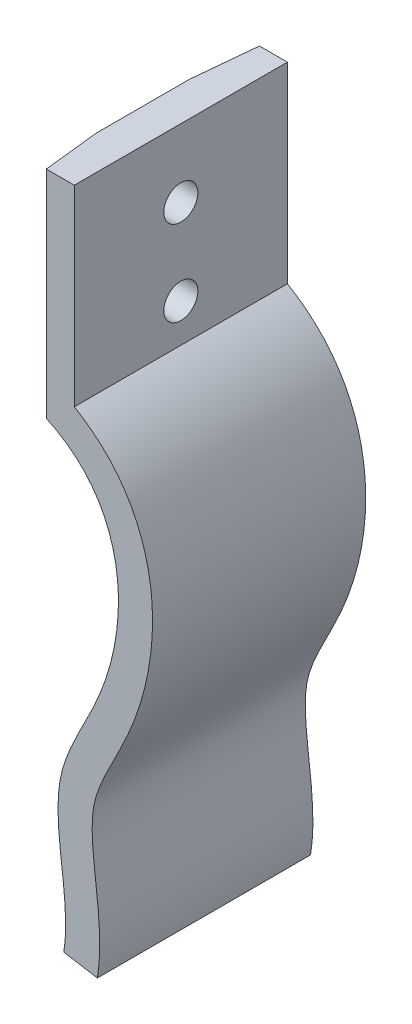
ISO-10303-21;
HEADER;
FILE_DESCRIPTION(('STEP AP214'),'2;1');
FILE_NAME('part.step','',(''),(''),'','','');
FILE_SCHEMA(('AUTOMOTIVE_DESIGN { 1 0 10303 214 1 1 1 1 }'));
ENDSEC;
DATA;
#1=APPLICATION_CONTEXT('core data for automotive mechanical design processes');
#2=APPLICATION_PROTOCOL_DEFINITION('international standard','automotive_design',2000,#1);
#3=PRODUCT_CONTEXT('',#1,'mechanical');
#4=PRODUCT('Part','Part','',(#3));
#5=PRODUCT_RELATED_PRODUCT_CATEGORY('part','',(#4));
#6=PRODUCT_DEFINITION_FORMATION('','',#4);
#7=PRODUCT_DEFINITION_CONTEXT('part definition',#1,'design');
#8=PRODUCT_DEFINITION('design','',#6,#7);
#9=PRODUCT_DEFINITION_SHAPE('','',#8);
#10=(LENGTH_UNIT() NAMED_UNIT(*) SI_UNIT(.MILLI.,.METRE.));
#11=(NAMED_UNIT(*) PLANE_ANGLE_UNIT() SI_UNIT($,.RADIAN.));
#12=(NAMED_UNIT(*) SI_UNIT($,.STERADIAN.) SOLID_ANGLE_UNIT());
#13=UNCERTAINTY_MEASURE_WITH_UNIT(LENGTH_MEASURE(1.E-05),#10,'distance_accuracy_value','');
#14=(GEOMETRIC_REPRESENTATION_CONTEXT(3) GLOBAL_UNCERTAINTY_ASSIGNED_CONTEXT((#13)) GLOBAL_UNIT_ASSIGNED_CONTEXT((#10,
#11,#12)) REPRESENTATION_CONTEXT('',''));
#15=CARTESIAN_POINT('',(0.,0.,0.));
#16=DIRECTION('',(0.,0.,1.));
#17=DIRECTION('',(1.,0.,0.));
#18=AXIS2_PLACEMENT_3D('',#15,#16,#17);
#19=CARTESIAN_POINT('',(0.,46.8099320882852,25.));
#20=DIRECTION('',(0.,-1.,0.));
#21=DIRECTION('',(0.,0.,-1.));
#22=AXIS2_PLACEMENT_3D('',#19,#20,#21);
#23=PLANE('',#22);
#24=DIRECTION('',(0.,0.,-1.));
#25=VECTOR('',#24,1.);
#26=CARTESIAN_POINT('',(0.,46.8099320882852,25.));
#27=LINE('',#26,#25);
#28=CARTESIAN_POINT('',(0.,46.8099320882852,18.4293009790218));
#29=VERTEX_POINT('',#28);
#30=CARTESIAN_POINT('',(0.,46.8099320882852,7.4868141937021));
#31=VERTEX_POINT('',#30);
#32=EDGE_CURVE('E108',#29,#31,#27,.T.);
#33=ORIENTED_EDGE('',*,*,#32,.F.);
#34=DIRECTION('',(-0.109088688674291,0.,-0.994032020612678));
#35=VECTOR('',#34,1.);
#36=CARTESIAN_POINT('',(0.,46.8099320882852,18.4293009790218));
#37=LINE('',#36,#35);
#38=CARTESIAN_POINT('',(0.721092404478242,46.8099320882852,25.));
#39=VERTEX_POINT('',#38);
#40=EDGE_CURVE('E98',#39,#29,#37,.T.);
#41=ORIENTED_EDGE('',*,*,#40,.F.);
#42=DIRECTION('',(-1.,0.,0.));
#43=VECTOR('',#42,1.);
#44=CARTESIAN_POINT('',(0.,46.8099320882852,25.));
#45=LINE('',#44,#43);
#46=CARTESIAN_POINT('',(4.,46.8099320882852,25.));
#47=VERTEX_POINT('',#46);
#48=EDGE_CURVE('E107',#47,#39,#45,.T.);
#49=ORIENTED_EDGE('',*,*,#48,.F.);
#50=DIRECTION('',(0.,0.,-1.));
#51=VECTOR('',#50,1.);
#52=CARTESIAN_POINT('',(4.,46.8099320882852,25.));
#53=LINE('',#52,#51);
#54=CARTESIAN_POINT('',(4.,46.8099320882852,0.));
#55=VERTEX_POINT('',#54);
#56=EDGE_CURVE('E193',#47,#55,#53,.T.);
#57=ORIENTED_EDGE('',*,*,#56,.T.);
#58=DIRECTION('',(-1.,0.,0.));
#59=VECTOR('',#58,1.);
#60=CARTESIAN_POINT('',(0.,46.8099320882852,0.));
#61=LINE('',#60,#59);
#62=CARTESIAN_POINT('',(0.721092404478242,46.8099320882852,0.));
#63=VERTEX_POINT('',#62);
#64=EDGE_CURVE('E194',#55,#63,#61,.T.);
#65=ORIENTED_EDGE('',*,*,#64,.T.);
#66=DIRECTION('',(0.0958713336668867,0.,-0.995393734851155));
#67=VECTOR('',#66,1.);
#68=CARTESIAN_POINT('',(0.,46.8099320882852,7.4868141937021));
#69=LINE('',#68,#67);
#70=EDGE_CURVE('E56',#31,#63,#69,.T.);
#71=ORIENTED_EDGE('',*,*,#70,.F.);
#72=EDGE_LOOP('',(#33,#41,#49,#57,#65,#71));
#73=FACE_BOUND('',#72,.T.);
#74=ADVANCED_FACE('F35',(#73),#23,.F.);
#75=CARTESIAN_POINT('',(0.,46.8099320882852,25.));
#76=DIRECTION('',(1.,0.,0.));
#77=DIRECTION('',(0.,0.,-1.));
#78=AXIS2_PLACEMENT_3D('',#75,#76,#77);
#79=PLANE('',#78);
#80=CARTESIAN_POINT('',(0.,28.8099320882853,12.5));
#81=DIRECTION('',(1.,0.,0.));
#82=DIRECTION('',(0.,0.,-1.));
#83=AXIS2_PLACEMENT_3D('',#80,#81,#82);
#84=CIRCLE('',#83,2.);
#85=CARTESIAN_POINT('',(0.,28.8099320882853,10.5));
#86=VERTEX_POINT('',#85);
#87=EDGE_CURVE('E243',#86,#86,#84,.T.);
#88=ORIENTED_EDGE('',*,*,#87,.T.);
#89=EDGE_LOOP('',(#88));
#90=FACE_BOUND('',#89,.T.);
#91=CARTESIAN_POINT('',(0.,38.8099320882853,12.5));
#92=DIRECTION('',(1.,0.,0.));
#93=DIRECTION('',(0.,0.,-1.));
#94=AXIS2_PLACEMENT_3D('',#91,#92,#93);
#95=CIRCLE('',#94,2.);
#96=CARTESIAN_POINT('',(0.,38.8099320882853,10.5));
#97=VERTEX_POINT('',#96);
#98=EDGE_CURVE('E123',#97,#97,#95,.T.);
#99=ORIENTED_EDGE('',*,*,#98,.T.);
#100=EDGE_LOOP('',(#99));
#101=FACE_BOUND('',#100,.T.);
#102=DIRECTION('',(0.,0.,-1.));
#103=VECTOR('',#102,1.);
#104=CARTESIAN_POINT('',(0.,21.8099320882852,25.));
#105=LINE('',#104,#103);
#106=CARTESIAN_POINT('',(0.,21.8099320882852,18.4293009790218));
#107=VERTEX_POINT('',#106);
#108=CARTESIAN_POINT('',(0.,21.8099320882852,7.4868141937021));
#109=VERTEX_POINT('',#108);
#110=EDGE_CURVE('E222',#107,#109,#105,.T.);
#111=ORIENTED_EDGE('',*,*,#110,.F.);
#112=DIRECTION('',(0.,1.,0.));
#113=VECTOR('',#112,1.);
#114=CARTESIAN_POINT('',(0.,6.80993208828523,18.4293009790218));
#115=LINE('',#114,#113);
#116=EDGE_CURVE('E109',#107,#29,#115,.T.);
#117=ORIENTED_EDGE('',*,*,#116,.T.);
#118=ORIENTED_EDGE('',*,*,#32,.T.);
#119=DIRECTION('',(0.,1.,0.));
#120=VECTOR('',#119,1.);
#121=CARTESIAN_POINT('',(0.,6.80993208828523,7.4868141937021));
#122=LINE('',#121,#120);
#123=EDGE_CURVE('E241',#109,#31,#122,.T.);
#124=ORIENTED_EDGE('',*,*,#123,.F.);
#125=EDGE_LOOP('',(#111,#117,#118,#124));
#126=FACE_BOUND('',#125,.T.);
#127=ADVANCED_FACE('F139',(#90,#101,#126),#79,.F.);
#128=CARTESIAN_POINT('',(0.,21.8099320882852,25.));
#129=CARTESIAN_POINT('',(10.5686827842886,17.4852676011584,25.));
#130=CARTESIAN_POINT('',(10.8615100748787,0.820586193006179,25.));
#131=CARTESIAN_POINT('',(0.99834577224949,-13.7254003912965,25.));
#132=CARTESIAN_POINT('',(2.79589400454801,-23.6402059962776,25.));
#133=CARTESIAN_POINT('',(3.12109811260812,-29.5799491291415,25.));
#134=CARTESIAN_POINT('',(2.76842728826482,-31.7068760611205,25.));
#135=B_SPLINE_CURVE_WITH_KNOTS('',3,(#128,#129,#130,#131,#132,#133,#134),.UNSPECIFIED.,.F.,.F.,
(4,1,1,1,4),(0.,0.502231834433406,0.695448005111488,0.885832632358506,1.),.UNSPECIFIED.);
#136=DIRECTION('',(0.,0.,-1.));
#137=VECTOR('',#136,1.);
#138=SURFACE_OF_LINEAR_EXTRUSION('',#135,#137);
#139=CARTESIAN_POINT('',(0.721092394730447,21.495615475943,25.));
#140=VERTEX_POINT('',#139);
#141=CARTESIAN_POINT('',(2.76842728826482,-31.7068760611205,25.));
#142=VERTEX_POINT('',#141);
#143=EDGE_CURVE('E115',#140,#142,#135,.T.);
#144=ORIENTED_EDGE('',*,*,#143,.F.);
#145=CARTESIAN_POINT('',(0.721092399516733,21.4956154759701,24.9999999994683));
#146=CARTESIAN_POINT('',(0.661010105353321,21.5234702833525,24.4525213551654));
#147=CARTESIAN_POINT('',(0.600925434860544,21.5508939387932,23.9050210741576));
#148=CARTESIAN_POINT('',(0.480751738615199,21.6049026764042,22.8099808412731));
#149=CARTESIAN_POINT('',(0.42066271287246,21.6314877604113,22.2624408894861));
#150=CARTESIAN_POINT('',(0.300480442153524,21.6838432067854,21.1673225359189));
#151=CARTESIAN_POINT('',(0.240387197177458,21.7096135691777,20.61974413414));
#152=CARTESIAN_POINT('',(0.120196592366304,21.7603617364293,19.5245498353874));
#153=CARTESIAN_POINT('',(0.0600992325224912,21.7853395395524,18.9769339383342));
#154=CARTESIAN_POINT('',(0.,21.8099320882852,18.4293009790218));
#155=B_SPLINE_CURVE_WITH_KNOTS('',3,(#145,#146,#147,#148,#149,#150,#151,#152,#153,#154),
.UNSPECIFIED.,.F.,.F.,(4,2,2,2,4),(0.,1.65440835410544,3.30881308412408,4.96321776299165,
6.61762606594613),.UNSPECIFIED.);
#156=EDGE_CURVE('E48',#140,#107,#155,.T.);
#157=ORIENTED_EDGE('',*,*,#156,.T.);
#158=ORIENTED_EDGE('',*,*,#110,.T.);
#159=CARTESIAN_POINT('',(0.,21.8099320882852,7.4868141937021));
#160=CARTESIAN_POINT('',(0.0600973690353866,21.7853403013797,6.86284723370639));
#161=CARTESIAN_POINT('',(0.120193291295766,21.760363111207,6.23889529499727));
#162=CARTESIAN_POINT('',(0.240381956179195,21.709615801129,4.99102443048241));
#163=CARTESIAN_POINT('',(0.300474698807457,21.6838456825668,4.36710550462255));
#164=CARTESIAN_POINT('',(0.420656923345942,21.6314903087358,3.11930150763486));
#165=CARTESIAN_POINT('',(0.480746405256086,21.6049050534474,2.49541643650783));
#166=CARTESIAN_POINT('',(0.600922004621707,21.5508955002975,1.2476812260417));
#167=CARTESIAN_POINT('',(0.661008122071313,21.523471201015,0.623831086763546));
#168=CARTESIAN_POINT('',(0.721092404371343,21.4956154714733,1.10988995771777E-09));
#169=B_SPLINE_CURVE_WITH_KNOTS('',3,(#159,#160,#161,#162,#163,#164,#165,#166,#167,#168),
.UNSPECIFIED.,.F.,.F.,(4,2,2,2,4),(0.,1.88200973996508,3.7640162924862,5.64602289007356,
7.52803267510479),.UNSPECIFIED.);
#170=CARTESIAN_POINT('',(0.721092404478242,21.495615475943,0.));
#171=VERTEX_POINT('',#170);
#172=EDGE_CURVE('E144',#109,#171,#169,.T.);
#173=ORIENTED_EDGE('',*,*,#172,.T.);
#174=CARTESIAN_POINT('',(0.,21.8099320882852,0.));
#175=CARTESIAN_POINT('',(10.5686827842886,17.4852676011584,0.));
#176=CARTESIAN_POINT('',(10.8615100748787,0.820586193006179,0.));
#177=CARTESIAN_POINT('',(0.99834577224949,-13.7254003912965,0.));
#178=CARTESIAN_POINT('',(2.79589400454801,-23.6402059962776,0.));
#179=CARTESIAN_POINT('',(3.12109811260812,-29.5799491291415,0.));
#180=CARTESIAN_POINT('',(2.76842728826482,-31.7068760611205,0.));
#181=B_SPLINE_CURVE_WITH_KNOTS('',3,(#174,#175,#176,#177,#178,#179,#180),.UNSPECIFIED.,.F.,.F.,
(4,1,1,1,4),(0.,0.502231834433406,0.695448005111488,0.885832632358506,1.),.UNSPECIFIED.);
#182=CARTESIAN_POINT('',(2.76842728826482,-31.7068760611205,0.));
#183=VERTEX_POINT('',#182);
#184=EDGE_CURVE('E197',#171,#183,#181,.T.);
#185=ORIENTED_EDGE('',*,*,#184,.T.);
#186=DIRECTION('',(0.,0.,-1.));
#187=VECTOR('',#186,1.);
#188=CARTESIAN_POINT('',(2.76842728826482,-31.7068760611205,25.));
#189=LINE('',#188,#187);
#190=EDGE_CURVE('E219',#142,#183,#189,.T.);
#191=ORIENTED_EDGE('',*,*,#190,.F.);
#192=EDGE_LOOP('',(#144,#157,#158,#173,#185,#191));
#193=FACE_BOUND('',#192,.T.);
#194=ADVANCED_FACE('F134',(#193),#138,.F.);
#195=CARTESIAN_POINT('',(2.76842728826482,-31.7068760611205,25.));
#196=DIRECTION('',(0.163578932148585,0.986530249387787,0.));
#197=DIRECTION('',(-0.986530249387787,0.163578932148585,0.));
#198=AXIS2_PLACEMENT_3D('',#195,#196,#197);
#199=PLANE('',#198);
#200=DIRECTION('',(0.986530249387787,-0.163578932148585,0.));
#201=VECTOR('',#200,1.);
#202=CARTESIAN_POINT('',(2.76842728826482,-31.7068760611205,0.));
#203=LINE('',#202,#201);
#204=CARTESIAN_POINT('',(6.71454828581596,-32.3611917897149,0.));
#205=VERTEX_POINT('',#204);
#206=EDGE_CURVE('E201',#183,#205,#203,.T.);
#207=ORIENTED_EDGE('',*,*,#206,.T.);
#208=DIRECTION('',(0.,0.,-1.));
#209=VECTOR('',#208,1.);
#210=CARTESIAN_POINT('',(6.71454828581596,-32.3611917897149,25.));
#211=LINE('',#210,#209);
#212=CARTESIAN_POINT('',(6.71454828581596,-32.3611917897149,25.));
#213=VERTEX_POINT('',#212);
#214=EDGE_CURVE('E216',#213,#205,#211,.T.);
#215=ORIENTED_EDGE('',*,*,#214,.F.);
#216=DIRECTION('',(0.986530249387787,-0.163578932148585,0.));
#217=VECTOR('',#216,1.);
#218=CARTESIAN_POINT('',(2.76842728826482,-31.7068760611205,25.));
#219=LINE('',#218,#217);
#220=EDGE_CURVE('E118',#142,#213,#219,.T.);
#221=ORIENTED_EDGE('',*,*,#220,.F.);
#222=ORIENTED_EDGE('',*,*,#190,.T.);
#223=EDGE_LOOP('',(#207,#215,#221,#222));
#224=FACE_BOUND('',#223,.T.);
#225=ADVANCED_FACE('F138',(#224),#199,.F.);
#226=CARTESIAN_POINT('',(6.71454828581596,-32.3611917897149,25.));
#227=CARTESIAN_POINT('',(6.83124759243547,-31.6573884664474,25.));
#228=CARTESIAN_POINT('',(6.98284183499744,-30.2151073837524,25.));
#229=CARTESIAN_POINT('',(7.01194691014185,-27.4799859611805,25.));
#230=CARTESIAN_POINT('',(6.72242121673403,-24.2352743945149,25.));
#231=CARTESIAN_POINT('',(6.26656426250574,-20.6750144799723,25.));
#232=CARTESIAN_POINT('',(6.0651757566099,-18.0480492035572,25.));
#233=CARTESIAN_POINT('',(6.12138674145766,-16.2109757110153,25.));
#234=CARTESIAN_POINT('',(6.27794731469007,-15.0010210134403,25.));
#235=CARTESIAN_POINT('',(6.57507248431768,-13.8551639172731,25.));
#236=CARTESIAN_POINT('',(7.20426726139495,-12.1464529437661,25.));
#237=CARTESIAN_POINT('',(8.37272706509447,-9.75875169403937,25.));
#238=CARTESIAN_POINT('',(9.81041619487255,-6.98452993651812,25.));
#239=CARTESIAN_POINT('',(10.8990123628362,-4.45213931153455,25.));
#240=CARTESIAN_POINT('',(11.83308696919,-1.84859097233092,25.));
#241=CARTESIAN_POINT('',(12.7186419489476,1.53084224442489,25.));
#242=CARTESIAN_POINT('',(13.249891479627,5.70177561845053,25.));
#243=CARTESIAN_POINT('',(13.1594593292001,9.91075009344416,25.));
#244=CARTESIAN_POINT('',(12.3263656102015,14.0661605170769,25.));
#245=CARTESIAN_POINT('',(10.6090174083808,18.0308616769152,25.));
#246=CARTESIAN_POINT('',(8.33392531467845,20.9925579135625,25.));
#247=CARTESIAN_POINT('',(6.02204330170187,23.0113179550629,25.));
#248=CARTESIAN_POINT('',(4.68524148505429,23.9003751788177,25.));
#249=CARTESIAN_POINT('',(3.99999999999965,24.2963952003644,25.));
#250=B_SPLINE_CURVE_WITH_KNOTS('',3,(#226,#227,#228,#229,#230,#231,#232,#233,#234,#235,#236,
#237,#238,#239,#240,#241,#242,#243,#244,#245,#246,#247,#248,#249),.UNSPECIFIED.,.F.,.F.,(4,1,1,
1,1,1,1,1,1,1,1,1,1,1,1,1,1,1,1,1,1,4),(0.0338645419096842,0.0640562749750065,
0.0942480080403289,0.154631474170974,0.215014940301618,0.275398406432263,0.305590139497586,
0.335781872562908,0.36597360562823,0.396165338693553,0.456548804824197,0.516932270954842,
0.547124004020164,0.577315737085487,0.637699203216132,0.698082669346776,0.758466135477421,
0.818849601608066,0.879233067738711,0.939616533869355,0.969808266934678,1.),.UNSPECIFIED.);
#251=DIRECTION('',(0.,0.,-1.));
#252=VECTOR('',#251,1.);
#253=SURFACE_OF_LINEAR_EXTRUSION('',#250,#252);
#254=CARTESIAN_POINT('',(6.71454828581596,-32.3611917897149,0.));
#255=CARTESIAN_POINT('',(6.83124759243547,-31.6573884664474,0.));
#256=CARTESIAN_POINT('',(6.98284183499744,-30.2151073837524,0.));
#257=CARTESIAN_POINT('',(7.01194691014185,-27.4799859611805,0.));
#258=CARTESIAN_POINT('',(6.72242121673403,-24.2352743945149,0.));
#259=CARTESIAN_POINT('',(6.26656426250574,-20.6750144799723,0.));
#260=CARTESIAN_POINT('',(6.0651757566099,-18.0480492035572,0.));
#261=CARTESIAN_POINT('',(6.12138674145766,-16.2109757110153,0.));
#262=CARTESIAN_POINT('',(6.27794731469007,-15.0010210134403,0.));
#263=CARTESIAN_POINT('',(6.57507248431768,-13.8551639172731,0.));
#264=CARTESIAN_POINT('',(7.20426726139495,-12.1464529437661,0.));
#265=CARTESIAN_POINT('',(8.37272706509447,-9.75875169403937,0.));
#266=CARTESIAN_POINT('',(9.81041619487255,-6.98452993651812,0.));
#267=CARTESIAN_POINT('',(10.8990123628362,-4.45213931153455,0.));
#268=CARTESIAN_POINT('',(11.83308696919,-1.84859097233092,0.));
#269=CARTESIAN_POINT('',(12.7186419489476,1.53084224442489,0.));
#270=CARTESIAN_POINT('',(13.249891479627,5.70177561845053,0.));
#271=CARTESIAN_POINT('',(13.1594593292001,9.91075009344416,0.));
#272=CARTESIAN_POINT('',(12.3263656102015,14.0661605170769,0.));
#273=CARTESIAN_POINT('',(10.6090174083808,18.0308616769152,0.));
#274=CARTESIAN_POINT('',(8.33392531467845,20.9925579135625,0.));
#275=CARTESIAN_POINT('',(6.02204330170187,23.0113179550629,0.));
#276=CARTESIAN_POINT('',(4.68524148505429,23.9003751788177,0.));
#277=CARTESIAN_POINT('',(3.99999999999965,24.2963952003644,0.));
#278=B_SPLINE_CURVE_WITH_KNOTS('',3,(#254,#255,#256,#257,#258,#259,#260,#261,#262,#263,#264,
#265,#266,#267,#268,#269,#270,#271,#272,#273,#274,#275,#276,#277),.UNSPECIFIED.,.F.,.F.,(4,1,1,
1,1,1,1,1,1,1,1,1,1,1,1,1,1,1,1,1,1,4),(0.0338645419096842,0.0640562749750065,
0.0942480080403289,0.154631474170974,0.215014940301618,0.275398406432263,0.305590139497586,
0.335781872562908,0.36597360562823,0.396165338693553,0.456548804824197,0.516932270954842,
0.547124004020164,0.577315737085487,0.637699203216132,0.698082669346776,0.758466135477421,
0.818849601608066,0.879233067738711,0.939616533869355,0.969808266934678,1.),.UNSPECIFIED.);
#279=CARTESIAN_POINT('',(3.99999999999965,24.2963952003644,0.));
#280=VERTEX_POINT('',#279);
#281=EDGE_CURVE('E120',#205,#280,#278,.T.);
#282=ORIENTED_EDGE('',*,*,#281,.T.);
#283=DIRECTION('',(0.,0.,-1.));
#284=VECTOR('',#283,1.);
#285=CARTESIAN_POINT('',(3.99999999999965,24.2963952003644,25.));
#286=LINE('',#285,#284);
#287=CARTESIAN_POINT('',(3.99999999999965,24.2963952003644,25.));
#288=VERTEX_POINT('',#287);
#289=EDGE_CURVE('E213',#288,#280,#286,.T.);
#290=ORIENTED_EDGE('',*,*,#289,.F.);
#291=EDGE_CURVE('E184',#213,#288,#250,.T.);
#292=ORIENTED_EDGE('',*,*,#291,.F.);
#293=ORIENTED_EDGE('',*,*,#214,.T.);
#294=EDGE_LOOP('',(#282,#290,#292,#293));
#295=FACE_BOUND('',#294,.T.);
#296=ADVANCED_FACE('F180',(#295),#253,.F.);
#297=CARTESIAN_POINT('',(4.,46.8099320882852,25.));
#298=DIRECTION('',(-1.,0.,0.));
#299=DIRECTION('',(0.,-1.,0.));
#300=AXIS2_PLACEMENT_3D('',#297,#298,#299);
#301=PLANE('',#300);
#302=CARTESIAN_POINT('',(3.99999999999986,28.8099320882852,12.5));
#303=DIRECTION('',(1.,0.,0.));
#304=DIRECTION('',(0.,1.,0.));
#305=AXIS2_PLACEMENT_3D('',#302,#303,#304);
#306=CIRCLE('',#305,2.);
#307=CARTESIAN_POINT('',(3.9999999999999,30.8099320882852,12.5));
#308=VERTEX_POINT('',#307);
#309=EDGE_CURVE('E240',#308,#308,#306,.T.);
#310=ORIENTED_EDGE('',*,*,#309,.F.);
#311=EDGE_LOOP('',(#310));
#312=FACE_BOUND('',#311,.T.);
#313=CARTESIAN_POINT('',(4.00000000000006,38.8099320882852,12.5));
#314=DIRECTION('',(1.,0.,0.));
#315=DIRECTION('',(0.,1.,0.));
#316=AXIS2_PLACEMENT_3D('',#313,#314,#315);
#317=CIRCLE('',#316,2.);
#318=CARTESIAN_POINT('',(4.0000000000001,40.8099320882852,12.5));
#319=VERTEX_POINT('',#318);
#320=EDGE_CURVE('E256',#319,#319,#317,.T.);
#321=ORIENTED_EDGE('',*,*,#320,.F.);
#322=EDGE_LOOP('',(#321));
#323=FACE_BOUND('',#322,.T.);
#324=DIRECTION('',(0.,1.,0.));
#325=VECTOR('',#324,1.);
#326=CARTESIAN_POINT('',(4.,46.8099320882852,0.));
#327=LINE('',#326,#325);
#328=EDGE_CURVE('E116',#280,#55,#327,.T.);
#329=ORIENTED_EDGE('',*,*,#328,.T.);
#330=ORIENTED_EDGE('',*,*,#56,.F.);
#331=DIRECTION('',(0.,1.,0.));
#332=VECTOR('',#331,1.);
#333=CARTESIAN_POINT('',(4.,46.8099320882852,25.));
#334=LINE('',#333,#332);
#335=EDGE_CURVE('E113',#288,#47,#334,.T.);
#336=ORIENTED_EDGE('',*,*,#335,.F.);
#337=ORIENTED_EDGE('',*,*,#289,.T.);
#338=EDGE_LOOP('',(#329,#330,#336,#337));
#339=FACE_BOUND('',#338,.T.);
#340=ADVANCED_FACE('F175',(#312,#323,#339),#301,.F.);
#341=CARTESIAN_POINT('',(10.0774356422086,-6.32534784535835,25.));
#342=DIRECTION('',(0.,0.,1.));
#343=DIRECTION('',(1.,0.,0.));
#344=AXIS2_PLACEMENT_3D('',#341,#342,#343);
#345=PLANE('',#344);
#346=DIRECTION('',(0.,1.,0.));
#347=VECTOR('',#346,1.);
#348=CARTESIAN_POINT('',(0.721092404478242,-6.32534784535835,25.));
#349=LINE('',#348,#347);
#350=EDGE_CURVE('E11',#140,#39,#349,.T.);
#351=ORIENTED_EDGE('',*,*,#350,.F.);
#352=ORIENTED_EDGE('',*,*,#143,.T.);
#353=ORIENTED_EDGE('',*,*,#220,.T.);
#354=ORIENTED_EDGE('',*,*,#291,.T.);
#355=ORIENTED_EDGE('',*,*,#335,.T.);
#356=ORIENTED_EDGE('',*,*,#48,.T.);
#357=EDGE_LOOP('',(#351,#352,#353,#354,#355,#356));
#358=FACE_BOUND('',#357,.T.);
#359=ADVANCED_FACE('F111',(#358),#345,.T.);
#360=CARTESIAN_POINT('',(10.0774356422086,-6.32534784535835,0.));
#361=DIRECTION('',(0.,0.,1.));
#362=DIRECTION('',(1.,0.,0.));
#363=AXIS2_PLACEMENT_3D('',#360,#361,#362);
#364=PLANE('',#363);
#365=ORIENTED_EDGE('',*,*,#184,.F.);
#366=DIRECTION('',(0.,1.,0.));
#367=VECTOR('',#366,1.);
#368=CARTESIAN_POINT('',(0.721092404478242,-6.32534784535835,0.));
#369=LINE('',#368,#367);
#370=EDGE_CURVE('E42',#171,#63,#369,.T.);
#371=ORIENTED_EDGE('',*,*,#370,.T.);
#372=ORIENTED_EDGE('',*,*,#64,.F.);
#373=ORIENTED_EDGE('',*,*,#328,.F.);
#374=ORIENTED_EDGE('',*,*,#281,.F.);
#375=ORIENTED_EDGE('',*,*,#206,.F.);
#376=EDGE_LOOP('',(#365,#371,#372,#373,#374,#375));
#377=FACE_BOUND('',#376,.T.);
#378=ADVANCED_FACE('F171',(#377),#364,.F.);
#379=CARTESIAN_POINT('',(-20.9999999999999,38.8099320882857,12.5));
#380=DIRECTION('',(1.,0.,0.));
#381=DIRECTION('',(0.,1.,0.));
#382=AXIS2_PLACEMENT_3D('',#379,#380,#381);
#383=CYLINDRICAL_SURFACE('',#382,2.);
#384=ORIENTED_EDGE('',*,*,#320,.T.);
#385=EDGE_LOOP('',(#384));
#386=FACE_BOUND('',#385,.T.);
#387=ORIENTED_EDGE('',*,*,#98,.F.);
#388=EDGE_LOOP('',(#387));
#389=FACE_BOUND('',#388,.T.);
#390=ADVANCED_FACE('F167',(#386,#389),#383,.F.);
#391=CARTESIAN_POINT('',(-21.0000000000001,28.8099320882857,12.5));
#392=DIRECTION('',(1.,0.,0.));
#393=DIRECTION('',(0.,1.,0.));
#394=AXIS2_PLACEMENT_3D('',#391,#392,#393);
#395=CYLINDRICAL_SURFACE('',#394,2.);
#396=ORIENTED_EDGE('',*,*,#309,.T.);
#397=EDGE_LOOP('',(#396));
#398=FACE_BOUND('',#397,.T.);
#399=ORIENTED_EDGE('',*,*,#87,.F.);
#400=EDGE_LOOP('',(#399));
#401=FACE_BOUND('',#400,.T.);
#402=ADVANCED_FACE('F164',(#398,#401),#395,.F.);
#403=CARTESIAN_POINT('',(0.,6.80993208828523,7.4868141937021));
#404=DIRECTION('',(0.995393734851156,0.,0.0958713336668867));
#405=DIRECTION('',(0.0958713336668867,0.,-0.995393734851156));
#406=AXIS2_PLACEMENT_3D('',#403,#404,#405);
#407=PLANE('',#406);
#408=ORIENTED_EDGE('',*,*,#123,.T.);
#409=ORIENTED_EDGE('',*,*,#70,.T.);
#410=ORIENTED_EDGE('',*,*,#370,.F.);
#411=ORIENTED_EDGE('',*,*,#172,.F.);
#412=EDGE_LOOP('',(#408,#409,#410,#411));
#413=FACE_BOUND('',#412,.T.);
#414=ADVANCED_FACE('F160',(#413),#407,.F.);
#415=CARTESIAN_POINT('',(0.,6.80993208828523,18.4293009790218));
#416=DIRECTION('',(0.994032020612678,0.,-0.109088688674291));
#417=DIRECTION('',(-0.109088688674291,0.,-0.994032020612678));
#418=AXIS2_PLACEMENT_3D('',#415,#416,#417);
#419=PLANE('',#418);
#420=ORIENTED_EDGE('',*,*,#350,.T.);
#421=ORIENTED_EDGE('',*,*,#40,.T.);
#422=ORIENTED_EDGE('',*,*,#116,.F.);
#423=ORIENTED_EDGE('',*,*,#156,.F.);
#424=EDGE_LOOP('',(#420,#421,#422,#423));
#425=FACE_BOUND('',#424,.T.);
#426=ADVANCED_FACE('F97',(#425),#419,.F.);
#427=CLOSED_SHELL('',(#74,#127,#194,#225,#296,#340,#359,#378,#390,#402,#414,#426));
#428=MANIFOLD_SOLID_BREP('B2',#427);
#429=ADVANCED_BREP_SHAPE_REPRESENTATION('',(#18,#428),#14);
#430=SHAPE_DEFINITION_REPRESENTATION(#9,#429);
ENDSEC;
END-ISO-10303-21;
